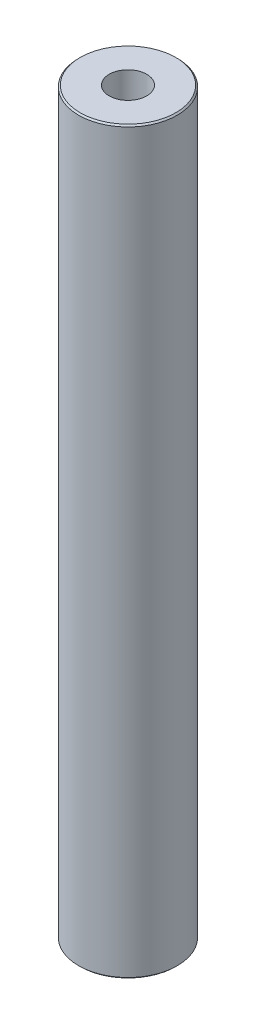
ISO-10303-21;
HEADER;
FILE_DESCRIPTION(('STEP AP214'),'2;1');
FILE_NAME('part.step','',(''),(''),'','','');
FILE_SCHEMA(('AUTOMOTIVE_DESIGN { 1 0 10303 214 1 1 1 1 }'));
ENDSEC;
DATA;
#1=APPLICATION_CONTEXT('core data for automotive mechanical design processes');
#2=APPLICATION_PROTOCOL_DEFINITION('international standard','automotive_design',2000,#1);
#3=PRODUCT_CONTEXT('',#1,'mechanical');
#4=PRODUCT('Part','Part','',(#3));
#5=PRODUCT_RELATED_PRODUCT_CATEGORY('part','',(#4));
#6=PRODUCT_DEFINITION_FORMATION('','',#4);
#7=PRODUCT_DEFINITION_CONTEXT('part definition',#1,'design');
#8=PRODUCT_DEFINITION('design','',#6,#7);
#9=PRODUCT_DEFINITION_SHAPE('','',#8);
#10=(LENGTH_UNIT() NAMED_UNIT(*) SI_UNIT(.MILLI.,.METRE.));
#11=(NAMED_UNIT(*) PLANE_ANGLE_UNIT() SI_UNIT($,.RADIAN.));
#12=(NAMED_UNIT(*) SI_UNIT($,.STERADIAN.) SOLID_ANGLE_UNIT());
#13=UNCERTAINTY_MEASURE_WITH_UNIT(LENGTH_MEASURE(1.E-05),#10,'distance_accuracy_value','');
#14=(GEOMETRIC_REPRESENTATION_CONTEXT(3) GLOBAL_UNCERTAINTY_ASSIGNED_CONTEXT((#13)) GLOBAL_UNIT_ASSIGNED_CONTEXT((#10,
#11,#12)) REPRESENTATION_CONTEXT('',''));
#15=CARTESIAN_POINT('',(0.,0.,0.));
#16=DIRECTION('',(0.,0.,1.));
#17=DIRECTION('',(1.,0.,0.));
#18=AXIS2_PLACEMENT_3D('',#15,#16,#17);
#19=CARTESIAN_POINT('',(0.,600.,0.));
#20=DIRECTION('',(0.,-1.,0.));
#21=DIRECTION('',(0.,0.,-1.));
#22=AXIS2_PLACEMENT_3D('',#19,#20,#21);
#23=CYLINDRICAL_SURFACE('',#22,40.);
#24=CARTESIAN_POINT('',(0.,598.818258877011,0.));
#25=DIRECTION('',(0.,1.,0.));
#26=DIRECTION('',(0.,0.,1.));
#27=AXIS2_PLACEMENT_3D('',#24,#25,#26);
#28=CIRCLE('',#27,40.);
#29=CARTESIAN_POINT('',(0.,598.818258877011,40.));
#30=VERTEX_POINT('',#29);
#31=EDGE_CURVE('E50',#30,#30,#28,.F.);
#32=ORIENTED_EDGE('',*,*,#31,.T.);
#33=EDGE_LOOP('',(#32));
#34=FACE_BOUND('',#33,.T.);
#35=CARTESIAN_POINT('',(0.,1.15788561849828,0.));
#36=DIRECTION('',(0.,1.,0.));
#37=DIRECTION('',(0.,0.,1.));
#38=AXIS2_PLACEMENT_3D('',#35,#36,#37);
#39=CIRCLE('',#38,40.);
#40=CARTESIAN_POINT('',(0.,1.15788561849828,40.));
#41=VERTEX_POINT('',#40);
#42=EDGE_CURVE('E51',#41,#41,#39,.T.);
#43=ORIENTED_EDGE('',*,*,#42,.T.);
#44=EDGE_LOOP('',(#43));
#45=FACE_BOUND('',#44,.T.);
#46=ADVANCED_FACE('F39',(#34,#45),#23,.T.);
#47=CARTESIAN_POINT('',(0.,600.,0.));
#48=DIRECTION('',(0.,1.,0.));
#49=DIRECTION('',(0.,0.,1.));
#50=AXIS2_PLACEMENT_3D('',#47,#48,#49);
#51=PLANE('',#50);
#52=CARTESIAN_POINT('',(0.,600.,0.));
#53=DIRECTION('',(0.,1.,0.));
#54=DIRECTION('',(0.,0.,1.));
#55=AXIS2_PLACEMENT_3D('',#52,#53,#54);
#56=CIRCLE('',#55,38.8421143815018);
#57=CARTESIAN_POINT('',(0.,600.,38.8421143815018));
#58=VERTEX_POINT('',#57);
#59=EDGE_CURVE('E54',#58,#58,#56,.T.);
#60=ORIENTED_EDGE('',*,*,#59,.T.);
#61=EDGE_LOOP('',(#60));
#62=FACE_BOUND('',#61,.T.);
#63=CARTESIAN_POINT('',(0.,600.,0.));
#64=DIRECTION('',(0.,1.,0.));
#65=DIRECTION('',(0.,0.,1.));
#66=AXIS2_PLACEMENT_3D('',#63,#64,#65);
#67=CIRCLE('',#66,15.2357271276951);
#68=CARTESIAN_POINT('',(0.,600.,15.2357271276951));
#69=VERTEX_POINT('',#68);
#70=EDGE_CURVE('E58',#69,#69,#67,.T.);
#71=ORIENTED_EDGE('',*,*,#70,.F.);
#72=EDGE_LOOP('',(#71));
#73=FACE_BOUND('',#72,.T.);
#74=ADVANCED_FACE('F69',(#62,#73),#51,.T.);
#75=CARTESIAN_POINT('',(0.,0.,0.));
#76=DIRECTION('',(0.,1.,0.));
#77=DIRECTION('',(0.,0.,1.));
#78=AXIS2_PLACEMENT_3D('',#75,#76,#77);
#79=PLANE('',#78);
#80=CARTESIAN_POINT('',(0.,0.,0.));
#81=DIRECTION('',(0.,1.,0.));
#82=DIRECTION('',(0.,0.,1.));
#83=AXIS2_PLACEMENT_3D('',#80,#81,#82);
#84=CIRCLE('',#83,38.8182588770108);
#85=CARTESIAN_POINT('',(0.,0.,38.8182588770108));
#86=VERTEX_POINT('',#85);
#87=EDGE_CURVE('E10',#86,#86,#84,.F.);
#88=ORIENTED_EDGE('',*,*,#87,.T.);
#89=EDGE_LOOP('',(#88));
#90=FACE_BOUND('',#89,.T.);
#91=CARTESIAN_POINT('',(0.,0.,0.));
#92=DIRECTION('',(0.,1.,0.));
#93=DIRECTION('',(0.,0.,1.));
#94=AXIS2_PLACEMENT_3D('',#91,#92,#93);
#95=CIRCLE('',#94,15.2357271276951);
#96=CARTESIAN_POINT('',(0.,0.,15.2357271276951));
#97=VERTEX_POINT('',#96);
#98=EDGE_CURVE('E63',#97,#97,#95,.T.);
#99=ORIENTED_EDGE('',*,*,#98,.T.);
#100=EDGE_LOOP('',(#99));
#101=FACE_BOUND('',#100,.T.);
#102=ADVANCED_FACE('F75',(#90,#101),#79,.F.);
#103=CARTESIAN_POINT('',(0.,600.,0.));
#104=DIRECTION('',(0.,-1.,0.));
#105=DIRECTION('',(0.,0.,-1.));
#106=AXIS2_PLACEMENT_3D('',#103,#104,#105);
#107=CYLINDRICAL_SURFACE('',#106,15.2357271276951);
#108=ORIENTED_EDGE('',*,*,#70,.T.);
#109=EDGE_LOOP('',(#108));
#110=FACE_BOUND('',#109,.T.);
#111=ORIENTED_EDGE('',*,*,#98,.F.);
#112=EDGE_LOOP('',(#111));
#113=FACE_BOUND('',#112,.T.);
#114=ADVANCED_FACE('F70',(#110,#113),#107,.F.);
#115=CARTESIAN_POINT('',(0.,600.,0.));
#116=DIRECTION('',(0.,-1.,0.));
#117=DIRECTION('',(0.,0.,-1.));
#118=AXIS2_PLACEMENT_3D('',#115,#116,#117);
#119=CONICAL_SURFACE('',#118,38.8421143815018,0.775202230254443);
#120=ORIENTED_EDGE('',*,*,#31,.F.);
#121=EDGE_LOOP('',(#120));
#122=FACE_BOUND('',#121,.T.);
#123=ORIENTED_EDGE('',*,*,#59,.F.);
#124=EDGE_LOOP('',(#123));
#125=FACE_BOUND('',#124,.T.);
#126=ADVANCED_FACE('F81',(#122,#125),#119,.T.);
#127=CARTESIAN_POINT('',(0.,1.15788561849828,0.));
#128=DIRECTION('',(0.,1.,0.));
#129=DIRECTION('',(0.,0.,1.));
#130=AXIS2_PLACEMENT_3D('',#127,#128,#129);
#131=CONICAL_SURFACE('',#130,40.,0.795594096540471);
#132=ORIENTED_EDGE('',*,*,#87,.F.);
#133=EDGE_LOOP('',(#132));
#134=FACE_BOUND('',#133,.T.);
#135=ORIENTED_EDGE('',*,*,#42,.F.);
#136=EDGE_LOOP('',(#135));
#137=FACE_BOUND('',#136,.T.);
#138=ADVANCED_FACE('F45',(#134,#137),#131,.T.);
#139=CLOSED_SHELL('',(#46,#74,#102,#114,#126,#138));
#140=MANIFOLD_SOLID_BREP('B2',#139);
#141=ADVANCED_BREP_SHAPE_REPRESENTATION('',(#18,#140),#14);
#142=SHAPE_DEFINITION_REPRESENTATION(#9,#141);
ENDSEC;
END-ISO-10303-21;
